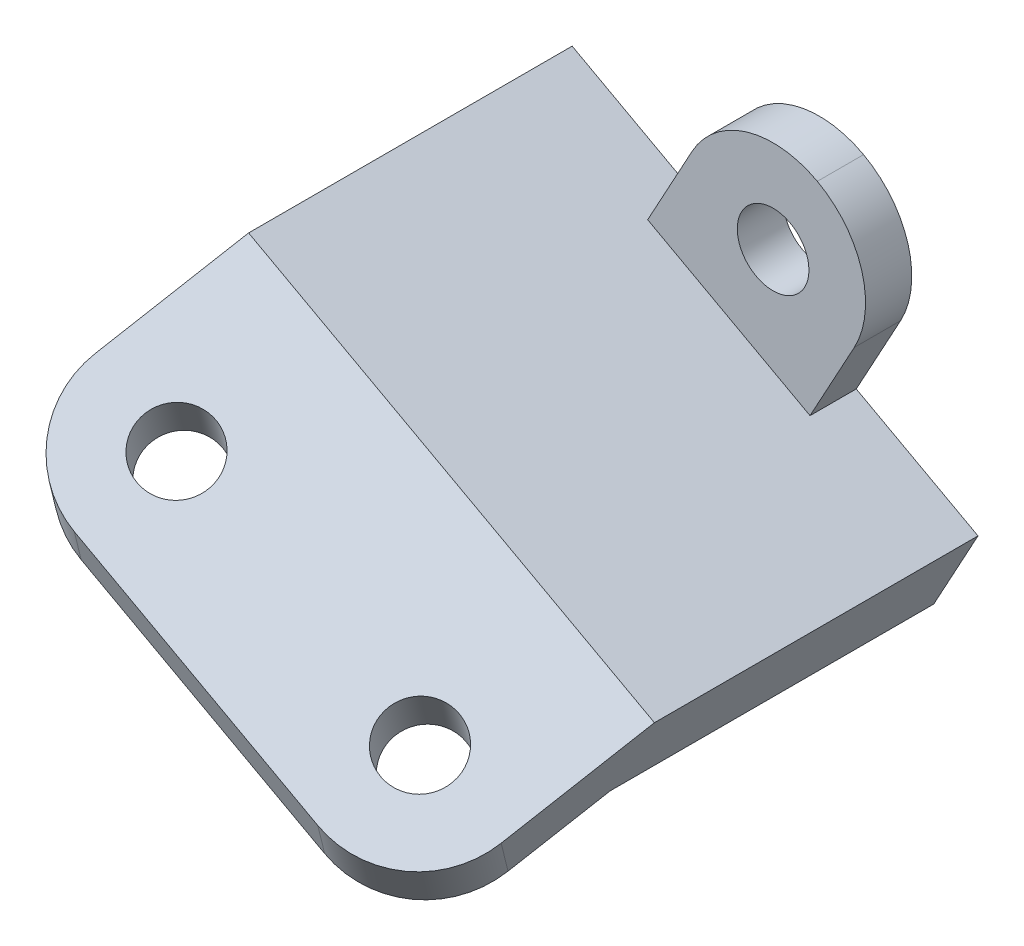
ISO-10303-21;
HEADER;
FILE_DESCRIPTION(('STEP AP214'),'2;1');
FILE_NAME('part.step','',(''),(''),'','','');
FILE_SCHEMA(('AUTOMOTIVE_DESIGN { 1 0 10303 214 1 1 1 1 }'));
ENDSEC;
DATA;
#1=APPLICATION_CONTEXT('core data for automotive mechanical design processes');
#2=APPLICATION_PROTOCOL_DEFINITION('international standard','automotive_design',2000,#1);
#3=PRODUCT_CONTEXT('',#1,'mechanical');
#4=PRODUCT('Part','Part','',(#3));
#5=PRODUCT_RELATED_PRODUCT_CATEGORY('part','',(#4));
#6=PRODUCT_DEFINITION_FORMATION('','',#4);
#7=PRODUCT_DEFINITION_CONTEXT('part definition',#1,'design');
#8=PRODUCT_DEFINITION('design','',#6,#7);
#9=PRODUCT_DEFINITION_SHAPE('','',#8);
#10=(LENGTH_UNIT() NAMED_UNIT(*) SI_UNIT(.MILLI.,.METRE.));
#11=(NAMED_UNIT(*) PLANE_ANGLE_UNIT() SI_UNIT($,.RADIAN.));
#12=(NAMED_UNIT(*) SI_UNIT($,.STERADIAN.) SOLID_ANGLE_UNIT());
#13=UNCERTAINTY_MEASURE_WITH_UNIT(LENGTH_MEASURE(1.E-05),#10,'distance_accuracy_value','');
#14=(GEOMETRIC_REPRESENTATION_CONTEXT(3) GLOBAL_UNCERTAINTY_ASSIGNED_CONTEXT((#13)) GLOBAL_UNIT_ASSIGNED_CONTEXT((#10,
#11,#12)) REPRESENTATION_CONTEXT('',''));
#15=CARTESIAN_POINT('',(0.,0.,0.));
#16=DIRECTION('',(0.,0.,1.));
#17=DIRECTION('',(1.,0.,0.));
#18=AXIS2_PLACEMENT_3D('',#15,#16,#17);
#19=CARTESIAN_POINT('',(53.4032280236198,101.07429996986,2.));
#20=DIRECTION('',(0.878015360581156,-0.478632454586546,0.));
#21=DIRECTION('',(0.478632454586546,0.878015360581156,0.));
#22=AXIS2_PLACEMENT_3D('',#19,#20,#21);
#23=PLANE('',#22);
#24=DIRECTION('',(-0.478632454586546,-0.878015360581156,0.));
#25=VECTOR('',#24,1.);
#26=CARTESIAN_POINT('',(53.4032280236198,101.07429996986,0.));
#27=LINE('',#26,#25);
#28=CARTESIAN_POINT('',(61.0613472970046,115.122545739158,0.));
#29=VERTEX_POINT('',#28);
#30=CARTESIAN_POINT('',(59.1468174786584,111.610484296834,0.));
#31=VERTEX_POINT('',#30);
#32=EDGE_CURVE('E254',#29,#31,#27,.T.);
#33=ORIENTED_EDGE('',*,*,#32,.T.);
#34=DIRECTION('',(0.,0.,1.));
#35=VECTOR('',#34,1.);
#36=CARTESIAN_POINT('',(59.1468174786584,111.610484296834,2.));
#37=LINE('',#36,#35);
#38=CARTESIAN_POINT('',(59.1468174786584,111.610484296834,2.));
#39=VERTEX_POINT('',#38);
#40=EDGE_CURVE('E229',#31,#39,#37,.T.);
#41=ORIENTED_EDGE('',*,*,#40,.T.);
#42=DIRECTION('',(-0.478632454586546,-0.878015360581156,0.));
#43=VECTOR('',#42,1.);
#44=CARTESIAN_POINT('',(53.4032280236198,101.07429996986,2.));
#45=LINE('',#44,#43);
#46=CARTESIAN_POINT('',(61.0613472970046,115.122545739158,2.));
#47=VERTEX_POINT('',#46);
#48=EDGE_CURVE('E245',#47,#39,#45,.T.);
#49=ORIENTED_EDGE('',*,*,#48,.F.);
#50=DIRECTION('',(0.,0.,-1.));
#51=VECTOR('',#50,1.);
#52=CARTESIAN_POINT('',(61.0613472970046,115.122545739158,2.));
#53=LINE('',#52,#51);
#54=EDGE_CURVE('E285',#47,#29,#53,.T.);
#55=ORIENTED_EDGE('',*,*,#54,.T.);
#56=EDGE_LOOP('',(#33,#41,#49,#55));
#57=FACE_BOUND('',#56,.T.);
#58=ADVANCED_FACE('F35',(#57),#23,.F.);
#59=CARTESIAN_POINT('',(70.,114.80554754479,2.));
#60=DIRECTION('',(-0.878015360581156,0.478632454586546,0.));
#61=DIRECTION('',(-0.478632454586546,-0.878015360581156,0.));
#62=AXIS2_PLACEMENT_3D('',#59,#60,#61);
#63=PLANE('',#62);
#64=DIRECTION('',(0.478632454586546,0.878015360581156,0.));
#65=VECTOR('',#64,1.);
#66=CARTESIAN_POINT('',(70.,114.80554754479,2.));
#67=LINE('',#66,#65);
#68=CARTESIAN_POINT('',(66.1709403633076,107.781424660141,2.));
#69=VERTEX_POINT('',#68);
#70=CARTESIAN_POINT('',(68.0854701816538,111.293486102466,2.));
#71=VERTEX_POINT('',#70);
#72=EDGE_CURVE('E248',#69,#71,#67,.T.);
#73=ORIENTED_EDGE('',*,*,#72,.F.);
#74=DIRECTION('',(0.,0.,-1.));
#75=VECTOR('',#74,1.);
#76=CARTESIAN_POINT('',(66.1709403633076,107.781424660141,2.));
#77=LINE('',#76,#75);
#78=CARTESIAN_POINT('',(66.1709403633076,107.781424660141,0.));
#79=VERTEX_POINT('',#78);
#80=EDGE_CURVE('E226',#69,#79,#77,.T.);
#81=ORIENTED_EDGE('',*,*,#80,.T.);
#82=DIRECTION('',(0.478632454586546,0.878015360581156,0.));
#83=VECTOR('',#82,1.);
#84=CARTESIAN_POINT('',(70.,114.80554754479,0.));
#85=LINE('',#84,#83);
#86=CARTESIAN_POINT('',(68.0854701816538,111.293486102466,0.));
#87=VERTEX_POINT('',#86);
#88=EDGE_CURVE('E257',#79,#87,#85,.T.);
#89=ORIENTED_EDGE('',*,*,#88,.T.);
#90=DIRECTION('',(0.,0.,-1.));
#91=VECTOR('',#90,1.);
#92=CARTESIAN_POINT('',(68.0854701816538,111.293486102466,2.));
#93=LINE('',#92,#91);
#94=EDGE_CURVE('E253',#87,#71,#93,.F.);
#95=ORIENTED_EDGE('',*,*,#94,.T.);
#96=EDGE_LOOP('',(#73,#81,#89,#95));
#97=FACE_BOUND('',#96,.T.);
#98=ADVANCED_FACE('F331',(#97),#63,.F.);
#99=CARTESIAN_POINT('',(0.,0.,2.));
#100=DIRECTION('',(0.,0.,-1.));
#101=DIRECTION('',(-1.,0.,0.));
#102=AXIS2_PLACEMENT_3D('',#99,#100,#101);
#103=PLANE('',#102);
#104=CARTESIAN_POINT('',(64.5734087393292,113.208015920812,2.));
#105=DIRECTION('',(0.,0.,1.));
#106=DIRECTION('',(1.,0.,0.));
#107=AXIS2_PLACEMENT_3D('',#104,#105,#106);
#108=CIRCLE('',#107,1.54999999999999);
#109=CARTESIAN_POINT('',(66.1234087393292,113.208015920812,2.));
#110=VERTEX_POINT('',#109);
#111=EDGE_CURVE('E239',#110,#110,#108,.T.);
#112=ORIENTED_EDGE('',*,*,#111,.F.);
#113=EDGE_LOOP('',(#112));
#114=FACE_BOUND('',#113,.T.);
#115=ORIENTED_EDGE('',*,*,#48,.T.);
#116=DIRECTION('',(0.878015360581156,-0.478632454586546,0.));
#117=VECTOR('',#116,1.);
#118=CARTESIAN_POINT('',(60.4538186597738,110.89799883069,2.));
#119=LINE('',#118,#117);
#120=EDGE_CURVE('E223',#39,#69,#119,.T.);
#121=ORIENTED_EDGE('',*,*,#120,.T.);
#122=ORIENTED_EDGE('',*,*,#72,.T.);
#123=CARTESIAN_POINT('',(64.5734087393292,113.208015920812,2.));
#124=DIRECTION('',(0.,0.,-1.));
#125=DIRECTION('',(-1.,0.,0.));
#126=AXIS2_PLACEMENT_3D('',#123,#124,#125);
#127=CIRCLE('',#126,4.);
#128=CARTESIAN_POINT('',(66.4879385576754,116.720077363137,2.));
#129=VERTEX_POINT('',#128);
#130=EDGE_CURVE('E279',#71,#129,#127,.F.);
#131=ORIENTED_EDGE('',*,*,#130,.T.);
#132=CARTESIAN_POINT('',(64.5734087393292,113.208015920812,2.));
#133=DIRECTION('',(0.,0.,-1.));
#134=DIRECTION('',(-1.,0.,0.));
#135=AXIS2_PLACEMENT_3D('',#132,#133,#134);
#136=CIRCLE('',#135,4.);
#137=EDGE_CURVE('E277',#129,#47,#136,.F.);
#138=ORIENTED_EDGE('',*,*,#137,.T.);
#139=EDGE_LOOP('',(#115,#121,#122,#131,#138));
#140=FACE_BOUND('',#139,.T.);
#141=ADVANCED_FACE('F335',(#114,#140),#103,.F.);
#142=CARTESIAN_POINT('',(57.2322876603122,108.098422854509,2.));
#143=VERTEX_POINT('',#142);
#144=CARTESIAN_POINT('',(55.317757841966,104.586361412184,2.));
#145=VERTEX_POINT('',#144);
#146=EDGE_CURVE('E249',#143,#145,#45,.T.);
#147=ORIENTED_EDGE('',*,*,#146,.F.);
#148=DIRECTION('',(0.,0.,-1.));
#149=VECTOR('',#148,1.);
#150=CARTESIAN_POINT('',(57.2322876603122,108.098422854509,2.));
#151=LINE('',#150,#149);
#152=CARTESIAN_POINT('',(57.2322876603122,108.098422854509,0.));
#153=VERTEX_POINT('',#152);
#154=EDGE_CURVE('E220',#143,#153,#151,.T.);
#155=ORIENTED_EDGE('',*,*,#154,.T.);
#156=CARTESIAN_POINT('',(55.317757841966,104.586361412184,0.));
#157=VERTEX_POINT('',#156);
#158=EDGE_CURVE('E258',#153,#157,#27,.T.);
#159=ORIENTED_EDGE('',*,*,#158,.T.);
#160=DIRECTION('',(0.,0.,-1.));
#161=VECTOR('',#160,1.);
#162=CARTESIAN_POINT('',(55.317757841966,104.586361412184,2.));
#163=LINE('',#162,#161);
#164=EDGE_CURVE('E287',#157,#145,#163,.F.);
#165=ORIENTED_EDGE('',*,*,#164,.T.);
#166=EDGE_LOOP('',(#147,#155,#159,#165));
#167=FACE_BOUND('',#166,.T.);
#168=ADVANCED_FACE('F385',(#167),#23,.F.);
#169=CARTESIAN_POINT('',(62.3418807266152,100.757301775492,0.));
#170=VERTEX_POINT('',#169);
#171=CARTESIAN_POINT('',(64.2564105449614,104.269363217817,0.));
#172=VERTEX_POINT('',#171);
#173=EDGE_CURVE('E259',#170,#172,#85,.T.);
#174=ORIENTED_EDGE('',*,*,#173,.T.);
#175=DIRECTION('',(0.,0.,1.));
#176=VECTOR('',#175,1.);
#177=CARTESIAN_POINT('',(64.2564105449614,104.269363217817,2.));
#178=LINE('',#177,#176);
#179=CARTESIAN_POINT('',(64.2564105449614,104.269363217817,2.));
#180=VERTEX_POINT('',#179);
#181=EDGE_CURVE('E217',#172,#180,#178,.T.);
#182=ORIENTED_EDGE('',*,*,#181,.T.);
#183=CARTESIAN_POINT('',(62.3418807266152,100.757301775492,2.));
#184=VERTEX_POINT('',#183);
#185=EDGE_CURVE('E250',#184,#180,#67,.T.);
#186=ORIENTED_EDGE('',*,*,#185,.F.);
#187=DIRECTION('',(0.,0.,-1.));
#188=VECTOR('',#187,1.);
#189=CARTESIAN_POINT('',(62.3418807266152,100.757301775492,2.));
#190=LINE('',#189,#188);
#191=EDGE_CURVE('E264',#184,#170,#190,.T.);
#192=ORIENTED_EDGE('',*,*,#191,.T.);
#193=EDGE_LOOP('',(#174,#182,#186,#192));
#194=FACE_BOUND('',#193,.T.);
#195=ADVANCED_FACE('F390',(#194),#63,.F.);
#196=CARTESIAN_POINT('',(58.8298192842906,102.671831593838,2.));
#197=DIRECTION('',(0.,0.,1.));
#198=DIRECTION('',(1.,0.,0.));
#199=AXIS2_PLACEMENT_3D('',#196,#197,#198);
#200=CIRCLE('',#199,1.55);
#201=CARTESIAN_POINT('',(60.3798192842906,102.671831593838,2.));
#202=VERTEX_POINT('',#201);
#203=EDGE_CURVE('E233',#202,#202,#200,.T.);
#204=ORIENTED_EDGE('',*,*,#203,.F.);
#205=EDGE_LOOP('',(#204));
#206=FACE_BOUND('',#205,.T.);
#207=ORIENTED_EDGE('',*,*,#185,.T.);
#208=DIRECTION('',(-0.878015360581156,0.478632454586547,0.));
#209=VECTOR('',#208,1.);
#210=CARTESIAN_POINT('',(58.5392888414276,107.385937388365,2.));
#211=LINE('',#210,#209);
#212=EDGE_CURVE('E180',#180,#143,#211,.T.);
#213=ORIENTED_EDGE('',*,*,#212,.T.);
#214=ORIENTED_EDGE('',*,*,#146,.T.);
#215=CARTESIAN_POINT('',(58.8298192842906,102.671831593838,2.));
#216=DIRECTION('',(0.,0.,-1.));
#217=DIRECTION('',(-1.,0.,0.));
#218=AXIS2_PLACEMENT_3D('',#215,#216,#217);
#219=CIRCLE('',#218,4.);
#220=CARTESIAN_POINT('',(56.9152894659444,99.1597701515135,2.));
#221=VERTEX_POINT('',#220);
#222=EDGE_CURVE('E281',#145,#221,#219,.F.);
#223=ORIENTED_EDGE('',*,*,#222,.T.);
#224=CARTESIAN_POINT('',(58.8298192842906,102.671831593838,2.));
#225=DIRECTION('',(0.,0.,-1.));
#226=DIRECTION('',(-1.,0.,0.));
#227=AXIS2_PLACEMENT_3D('',#224,#225,#226);
#228=CIRCLE('',#227,4.);
#229=EDGE_CURVE('E283',#221,#184,#228,.F.);
#230=ORIENTED_EDGE('',*,*,#229,.T.);
#231=EDGE_LOOP('',(#207,#213,#214,#223,#230));
#232=FACE_BOUND('',#231,.T.);
#233=ADVANCED_FACE('F398',(#206,#232),#103,.F.);
#234=CARTESIAN_POINT('',(0.,0.,0.));
#235=DIRECTION('',(0.,0.,-1.));
#236=DIRECTION('',(-1.,0.,0.));
#237=AXIS2_PLACEMENT_3D('',#234,#235,#236);
#238=PLANE('',#237);
#239=ORIENTED_EDGE('',*,*,#158,.F.);
#240=DIRECTION('',(0.878015360581156,-0.478632454586547,0.));
#241=VECTOR('',#240,1.);
#242=CARTESIAN_POINT('',(64.2564105449614,104.269363217817,0.));
#243=LINE('',#242,#241);
#244=CARTESIAN_POINT('',(51.9641954968253,110.970217582028,0.));
#245=VERTEX_POINT('',#244);
#246=EDGE_CURVE('E205',#245,#153,#243,.T.);
#247=ORIENTED_EDGE('',*,*,#246,.F.);
#248=DIRECTION('',(-0.478632454586541,-0.878015360581159,0.));
#249=VECTOR('',#248,1.);
#250=CARTESIAN_POINT('',(53.8787253151714,114.482279024353,0.));
#251=LINE('',#250,#249);
#252=CARTESIAN_POINT('',(53.8787253151714,114.482279024353,0.));
#253=VERTEX_POINT('',#252);
#254=EDGE_CURVE('E208',#253,#245,#251,.T.);
#255=ORIENTED_EDGE('',*,*,#254,.F.);
#256=DIRECTION('',(-0.878015360581156,0.478632454586546,0.));
#257=VECTOR('',#256,1.);
#258=CARTESIAN_POINT('',(59.1468174786584,111.610484296834,0.));
#259=LINE('',#258,#257);
#260=EDGE_CURVE('E200',#31,#253,#259,.T.);
#261=ORIENTED_EDGE('',*,*,#260,.F.);
#262=ORIENTED_EDGE('',*,*,#32,.F.);
#263=CARTESIAN_POINT('',(64.5734087393292,113.208015920812,0.));
#264=DIRECTION('',(0.,0.,-1.));
#265=DIRECTION('',(-1.,0.,0.));
#266=AXIS2_PLACEMENT_3D('',#263,#264,#265);
#267=CIRCLE('',#266,4.);
#268=CARTESIAN_POINT('',(66.4879385576754,116.720077363137,0.));
#269=VERTEX_POINT('',#268);
#270=EDGE_CURVE('E267',#29,#269,#267,.T.);
#271=ORIENTED_EDGE('',*,*,#270,.T.);
#272=CARTESIAN_POINT('',(64.5734087393292,113.208015920812,0.));
#273=DIRECTION('',(0.,0.,-1.));
#274=DIRECTION('',(-1.,0.,0.));
#275=AXIS2_PLACEMENT_3D('',#272,#273,#274);
#276=CIRCLE('',#275,4.);
#277=EDGE_CURVE('E269',#269,#87,#276,.T.);
#278=ORIENTED_EDGE('',*,*,#277,.T.);
#279=ORIENTED_EDGE('',*,*,#88,.F.);
#280=CARTESIAN_POINT('',(71.4390325267945,104.909629932622,0.));
#281=VERTEX_POINT('',#280);
#282=EDGE_CURVE('E201',#281,#79,#259,.T.);
#283=ORIENTED_EDGE('',*,*,#282,.F.);
#284=DIRECTION('',(0.478632454586546,0.878015360581156,0.));
#285=VECTOR('',#284,1.);
#286=CARTESIAN_POINT('',(69.5245027084484,101.397568490297,0.));
#287=LINE('',#286,#285);
#288=CARTESIAN_POINT('',(69.5245027084484,101.397568490297,0.));
#289=VERTEX_POINT('',#288);
#290=EDGE_CURVE('E179',#289,#281,#287,.T.);
#291=ORIENTED_EDGE('',*,*,#290,.F.);
#292=EDGE_CURVE('E207',#172,#289,#243,.T.);
#293=ORIENTED_EDGE('',*,*,#292,.F.);
#294=ORIENTED_EDGE('',*,*,#173,.F.);
#295=CARTESIAN_POINT('',(58.8298192842906,102.671831593838,0.));
#296=DIRECTION('',(0.,0.,-1.));
#297=DIRECTION('',(-1.,0.,0.));
#298=AXIS2_PLACEMENT_3D('',#295,#296,#297);
#299=CIRCLE('',#298,4.);
#300=CARTESIAN_POINT('',(56.9152894659444,99.1597701515135,0.));
#301=VERTEX_POINT('',#300);
#302=EDGE_CURVE('E275',#170,#301,#299,.T.);
#303=ORIENTED_EDGE('',*,*,#302,.T.);
#304=CARTESIAN_POINT('',(58.8298192842906,102.671831593838,0.));
#305=DIRECTION('',(0.,0.,-1.));
#306=DIRECTION('',(-1.,0.,0.));
#307=AXIS2_PLACEMENT_3D('',#304,#305,#306);
#308=CIRCLE('',#307,4.);
#309=EDGE_CURVE('E272',#301,#157,#308,.T.);
#310=ORIENTED_EDGE('',*,*,#309,.T.);
#311=EDGE_LOOP('',(#239,#247,#255,#261,#262,#271,#278,#279,#283,#291,#293,#294,#303,#310));
#312=FACE_BOUND('',#311,.T.);
#313=CARTESIAN_POINT('',(58.8298192842906,102.671831593838,0.));
#314=DIRECTION('',(0.,0.,-1.));
#315=DIRECTION('',(-1.,0.,0.));
#316=AXIS2_PLACEMENT_3D('',#313,#314,#315);
#317=CIRCLE('',#316,1.55);
#318=CARTESIAN_POINT('',(57.2798192842906,102.671831593838,0.));
#319=VERTEX_POINT('',#318);
#320=EDGE_CURVE('E232',#319,#319,#317,.F.);
#321=ORIENTED_EDGE('',*,*,#320,.T.);
#322=EDGE_LOOP('',(#321));
#323=FACE_BOUND('',#322,.T.);
#324=CARTESIAN_POINT('',(64.5734087393292,113.208015920812,0.));
#325=DIRECTION('',(0.,0.,-1.));
#326=DIRECTION('',(-1.,0.,0.));
#327=AXIS2_PLACEMENT_3D('',#324,#325,#326);
#328=CIRCLE('',#327,1.54999999999999);
#329=CARTESIAN_POINT('',(63.0234087393292,113.208015920812,0.));
#330=VERTEX_POINT('',#329);
#331=EDGE_CURVE('E236',#330,#330,#328,.F.);
#332=ORIENTED_EDGE('',*,*,#331,.T.);
#333=EDGE_LOOP('',(#332));
#334=FACE_BOUND('',#333,.T.);
#335=ADVANCED_FACE('F326',(#312,#323,#334),#238,.T.);
#336=CARTESIAN_POINT('',(58.8298192842906,102.671831593838,2.));
#337=DIRECTION('',(0.,0.,-1.));
#338=DIRECTION('',(-1.,0.,0.));
#339=AXIS2_PLACEMENT_3D('',#336,#337,#338);
#340=CYLINDRICAL_SURFACE('',#339,4.);
#341=DIRECTION('',(0.,0.,-1.));
#342=VECTOR('',#341,1.);
#343=CARTESIAN_POINT('',(56.9152894659444,99.1597701515135,2.));
#344=LINE('',#343,#342);
#345=EDGE_CURVE('E291',#221,#301,#344,.T.);
#346=ORIENTED_EDGE('',*,*,#345,.F.);
#347=ORIENTED_EDGE('',*,*,#222,.F.);
#348=ORIENTED_EDGE('',*,*,#164,.F.);
#349=ORIENTED_EDGE('',*,*,#309,.F.);
#350=EDGE_LOOP('',(#346,#347,#348,#349));
#351=FACE_BOUND('',#350,.T.);
#352=ADVANCED_FACE('F412',(#351),#340,.T.);
#353=CARTESIAN_POINT('',(58.8298192842906,102.671831593838,2.));
#354=DIRECTION('',(0.,0.,-1.));
#355=DIRECTION('',(-1.,0.,0.));
#356=AXIS2_PLACEMENT_3D('',#353,#354,#355);
#357=CYLINDRICAL_SURFACE('',#356,4.);
#358=ORIENTED_EDGE('',*,*,#229,.F.);
#359=ORIENTED_EDGE('',*,*,#345,.T.);
#360=ORIENTED_EDGE('',*,*,#302,.F.);
#361=ORIENTED_EDGE('',*,*,#191,.F.);
#362=EDGE_LOOP('',(#358,#359,#360,#361));
#363=FACE_BOUND('',#362,.T.);
#364=ADVANCED_FACE('F414',(#363),#357,.T.);
#365=CARTESIAN_POINT('',(64.5734087393292,113.208015920812,2.));
#366=DIRECTION('',(0.,0.,-1.));
#367=DIRECTION('',(-1.,0.,0.));
#368=AXIS2_PLACEMENT_3D('',#365,#366,#367);
#369=CYLINDRICAL_SURFACE('',#368,4.);
#370=ORIENTED_EDGE('',*,*,#54,.F.);
#371=ORIENTED_EDGE('',*,*,#137,.F.);
#372=DIRECTION('',(0.,0.,-1.));
#373=VECTOR('',#372,1.);
#374=CARTESIAN_POINT('',(66.4879385576754,116.720077363137,2.));
#375=LINE('',#374,#373);
#376=EDGE_CURVE('E242',#269,#129,#375,.F.);
#377=ORIENTED_EDGE('',*,*,#376,.F.);
#378=ORIENTED_EDGE('',*,*,#270,.F.);
#379=EDGE_LOOP('',(#370,#371,#377,#378));
#380=FACE_BOUND('',#379,.T.);
#381=ADVANCED_FACE('F344',(#380),#369,.T.);
#382=CARTESIAN_POINT('',(64.5734087393292,113.208015920812,2.));
#383=DIRECTION('',(0.,0.,-1.));
#384=DIRECTION('',(-1.,0.,0.));
#385=AXIS2_PLACEMENT_3D('',#382,#383,#384);
#386=CYLINDRICAL_SURFACE('',#385,4.);
#387=ORIENTED_EDGE('',*,*,#130,.F.);
#388=ORIENTED_EDGE('',*,*,#94,.F.);
#389=ORIENTED_EDGE('',*,*,#277,.F.);
#390=ORIENTED_EDGE('',*,*,#376,.T.);
#391=EDGE_LOOP('',(#387,#388,#389,#390));
#392=FACE_BOUND('',#391,.T.);
#393=ADVANCED_FACE('F338',(#392),#386,.T.);
#394=CARTESIAN_POINT('',(64.5734087393292,113.208015920812,-0.00100000000000013));
#395=DIRECTION('',(0.,0.,1.));
#396=DIRECTION('',(1.,0.,0.));
#397=AXIS2_PLACEMENT_3D('',#394,#395,#396);
#398=CYLINDRICAL_SURFACE('',#397,1.54999999999999);
#399=ORIENTED_EDGE('',*,*,#331,.F.);
#400=EDGE_LOOP('',(#399));
#401=FACE_BOUND('',#400,.T.);
#402=ORIENTED_EDGE('',*,*,#111,.T.);
#403=EDGE_LOOP('',(#402));
#404=FACE_BOUND('',#403,.T.);
#405=ADVANCED_FACE('F424',(#401,#404),#398,.F.);
#406=CARTESIAN_POINT('',(58.8298192842906,102.671831593838,-0.00100000000000013));
#407=DIRECTION('',(0.,0.,1.));
#408=DIRECTION('',(1.,0.,0.));
#409=AXIS2_PLACEMENT_3D('',#406,#407,#408);
#410=CYLINDRICAL_SURFACE('',#409,1.55);
#411=ORIENTED_EDGE('',*,*,#320,.F.);
#412=EDGE_LOOP('',(#411));
#413=FACE_BOUND('',#412,.T.);
#414=ORIENTED_EDGE('',*,*,#203,.T.);
#415=EDGE_LOOP('',(#414));
#416=FACE_BOUND('',#415,.T.);
#417=ADVANCED_FACE('F491',(#413,#416),#410,.F.);
#418=CARTESIAN_POINT('',(59.1468174786584,111.610484296834,-23.4622873374249));
#419=DIRECTION('',(0.478632454586546,0.878015360581156,0.));
#420=DIRECTION('',(-0.878015360581156,0.478632454586546,0.));
#421=AXIS2_PLACEMENT_3D('',#418,#419,#420);
#422=PLANE('',#421);
#423=ORIENTED_EDGE('',*,*,#40,.F.);
#424=ORIENTED_EDGE('',*,*,#260,.T.);
#425=DIRECTION('',(0.,0.,1.));
#426=VECTOR('',#425,1.);
#427=CARTESIAN_POINT('',(53.8787253151714,114.482279024353,-23.4622873374249));
#428=LINE('',#427,#426);
#429=CARTESIAN_POINT('',(53.8787253151714,114.482279024353,14.));
#430=VERTEX_POINT('',#429);
#431=EDGE_CURVE('E166',#253,#430,#428,.T.);
#432=ORIENTED_EDGE('',*,*,#431,.T.);
#433=DIRECTION('',(-0.878015360581156,0.478632454586547,0.));
#434=VECTOR('',#433,1.);
#435=CARTESIAN_POINT('',(66.1709403633076,107.781424660141,14.));
#436=LINE('',#435,#434);
#437=CARTESIAN_POINT('',(71.4390325267946,104.909629932622,14.));
#438=VERTEX_POINT('',#437);
#439=EDGE_CURVE('E161',#438,#430,#436,.T.);
#440=ORIENTED_EDGE('',*,*,#439,.F.);
#441=DIRECTION('',(0.,0.,1.));
#442=VECTOR('',#441,1.);
#443=CARTESIAN_POINT('',(71.4390325267945,104.909629932622,-23.4622873374249));
#444=LINE('',#443,#442);
#445=EDGE_CURVE('E164',#281,#438,#444,.T.);
#446=ORIENTED_EDGE('',*,*,#445,.F.);
#447=ORIENTED_EDGE('',*,*,#282,.T.);
#448=ORIENTED_EDGE('',*,*,#80,.F.);
#449=ORIENTED_EDGE('',*,*,#120,.F.);
#450=EDGE_LOOP('',(#423,#424,#432,#440,#446,#447,#448,#449));
#451=FACE_BOUND('',#450,.T.);
#452=ADVANCED_FACE('F163',(#451),#422,.T.);
#453=CARTESIAN_POINT('',(64.2564105449614,104.269363217817,-23.4622873374249));
#454=DIRECTION('',(-0.478632454586546,-0.878015360581156,0.));
#455=DIRECTION('',(0.878015360581156,-0.478632454586547,0.));
#456=AXIS2_PLACEMENT_3D('',#453,#454,#455);
#457=PLANE('',#456);
#458=ORIENTED_EDGE('',*,*,#154,.F.);
#459=ORIENTED_EDGE('',*,*,#212,.F.);
#460=ORIENTED_EDGE('',*,*,#181,.F.);
#461=ORIENTED_EDGE('',*,*,#292,.T.);
#462=DIRECTION('',(0.,0.,1.));
#463=VECTOR('',#462,1.);
#464=CARTESIAN_POINT('',(69.5245027084484,101.397568490297,-23.4622873374249));
#465=LINE('',#464,#463);
#466=CARTESIAN_POINT('',(69.5245027084484,101.397568490297,14.));
#467=VERTEX_POINT('',#466);
#468=EDGE_CURVE('E204',#289,#467,#465,.T.);
#469=ORIENTED_EDGE('',*,*,#468,.T.);
#470=DIRECTION('',(0.878015360581156,-0.478632454586547,0.));
#471=VECTOR('',#470,1.);
#472=CARTESIAN_POINT('',(51.9641954968253,110.970217582028,14.));
#473=LINE('',#472,#471);
#474=CARTESIAN_POINT('',(51.9641954968253,110.970217582028,14.));
#475=VERTEX_POINT('',#474);
#476=EDGE_CURVE('E168',#475,#467,#473,.T.);
#477=ORIENTED_EDGE('',*,*,#476,.F.);
#478=DIRECTION('',(0.,0.,1.));
#479=VECTOR('',#478,1.);
#480=CARTESIAN_POINT('',(51.9641954968253,110.970217582028,-23.4622873374249));
#481=LINE('',#480,#479);
#482=EDGE_CURVE('E210',#245,#475,#481,.T.);
#483=ORIENTED_EDGE('',*,*,#482,.F.);
#484=ORIENTED_EDGE('',*,*,#246,.T.);
#485=EDGE_LOOP('',(#458,#459,#460,#461,#469,#477,#483,#484));
#486=FACE_BOUND('',#485,.T.);
#487=ADVANCED_FACE('F321',(#486),#457,.T.);
#488=CARTESIAN_POINT('',(53.8787253151714,114.482279024353,-23.4622873374249));
#489=DIRECTION('',(-0.878015360581159,0.478632454586541,0.));
#490=DIRECTION('',(-0.478632454586541,-0.878015360581159,0.));
#491=AXIS2_PLACEMENT_3D('',#488,#489,#490);
#492=PLANE('',#491);
#493=DIRECTION('',(-0.239316227293269,-0.439007680290578,0.86602540378444));
#494=VECTOR('',#493,1.);
#495=CARTESIAN_POINT('',(40.2309283397022,89.4464184851707,56.4597510264363));
#496=LINE('',#495,#494);
#497=CARTESIAN_POINT('',(51.0069305876522,109.214186860866,17.4641016151378));
#498=VERTEX_POINT('',#497);
#499=EDGE_CURVE('E184',#475,#498,#496,.T.);
#500=ORIENTED_EDGE('',*,*,#499,.T.);
#501=DIRECTION('',(-0.414507864747645,-0.760383607176236,-0.500000000000003));
#502=VECTOR('',#501,1.);
#503=CARTESIAN_POINT('',(52.4428279514118,111.848232942609,19.1961524227067));
#504=LINE('',#503,#502);
#505=CARTESIAN_POINT('',(52.4428279514118,111.848232942609,19.1961524227066));
#506=VERTEX_POINT('',#505);
#507=EDGE_CURVE('E11',#498,#506,#504,.F.);
#508=ORIENTED_EDGE('',*,*,#507,.T.);
#509=DIRECTION('',(-0.239316227293271,-0.43900768029058,0.866025403784438));
#510=VECTOR('',#509,1.);
#511=CARTESIAN_POINT('',(41.6668257034616,92.0804645669138,58.1918018340054));
#512=LINE('',#511,#510);
#513=EDGE_CURVE('E186',#430,#506,#512,.T.);
#514=ORIENTED_EDGE('',*,*,#513,.F.);
#515=ORIENTED_EDGE('',*,*,#431,.F.);
#516=ORIENTED_EDGE('',*,*,#254,.T.);
#517=ORIENTED_EDGE('',*,*,#482,.T.);
#518=EDGE_LOOP('',(#500,#508,#514,#515,#516,#517));
#519=FACE_BOUND('',#518,.T.);
#520=ADVANCED_FACE('F350',(#519),#492,.T.);
#521=CARTESIAN_POINT('',(69.5245027084484,101.397568490297,-23.4622873374249));
#522=DIRECTION('',(0.878015360581156,-0.478632454586546,0.));
#523=DIRECTION('',(0.478632454586546,0.878015360581156,0.));
#524=AXIS2_PLACEMENT_3D('',#521,#522,#523);
#525=PLANE('',#524);
#526=DIRECTION('',(-0.239316227293273,-0.439007680290579,0.866025403784438));
#527=VECTOR('',#526,1.);
#528=CARTESIAN_POINT('',(59.2271329150847,82.5078154751831,58.1918018340053));
#529=LINE('',#528,#527);
#530=CARTESIAN_POINT('',(70.003135163035,102.275583850879,19.1961524227066));
#531=VERTEX_POINT('',#530);
#532=EDGE_CURVE('E169',#438,#531,#529,.T.);
#533=ORIENTED_EDGE('',*,*,#532,.T.);
#534=DIRECTION('',(-0.41450786474765,-0.760383607176234,-0.500000000000003));
#535=VECTOR('',#534,1.);
#536=CARTESIAN_POINT('',(68.5672377992754,99.6415377691351,17.4641016151378));
#537=LINE('',#536,#535);
#538=CARTESIAN_POINT('',(68.5672377992754,99.6415377691351,17.4641016151378));
#539=VERTEX_POINT('',#538);
#540=EDGE_CURVE('E290',#531,#539,#537,.T.);
#541=ORIENTED_EDGE('',*,*,#540,.T.);
#542=DIRECTION('',(-0.239316227293272,-0.439007680290576,0.86602540378444));
#543=VECTOR('',#542,1.);
#544=CARTESIAN_POINT('',(57.7912355513252,79.8737693934399,56.4597510264362));
#545=LINE('',#544,#543);
#546=EDGE_CURVE('E190',#467,#539,#545,.T.);
#547=ORIENTED_EDGE('',*,*,#546,.F.);
#548=ORIENTED_EDGE('',*,*,#468,.F.);
#549=ORIENTED_EDGE('',*,*,#290,.T.);
#550=ORIENTED_EDGE('',*,*,#445,.T.);
#551=EDGE_LOOP('',(#533,#541,#547,#548,#549,#550));
#552=FACE_BOUND('',#551,.T.);
#553=ADVANCED_FACE('F174',(#552),#525,.T.);
#554=CARTESIAN_POINT('',(31.15559963998,6.38037534027963,-35.5315477961612));
#555=DIRECTION('',(0.239316227293272,0.439007680290582,-0.866025403784437));
#556=DIRECTION('',(0.,0.891943793145156,0.452146292553451));
#557=AXIS2_PLACEMENT_3D('',#554,#555,#556);
#558=PLANE('',#557);
#559=DIRECTION('',(-0.878015360581159,0.478632454586541,0.));
#560=VECTOR('',#559,1.);
#561=CARTESIAN_POINT('',(77.9616213242836,92.2425136317874,20.9282032302755));
#562=LINE('',#561,#560);
#563=CARTESIAN_POINT('',(64.0979114477777,99.800036866319,20.9282032302755));
#564=VERTEX_POINT('',#563);
#565=CARTESIAN_POINT('',(53.5617271208038,105.543626321357,20.9282032302755));
#566=VERTEX_POINT('',#565);
#567=EDGE_CURVE('E192',#564,#566,#562,.T.);
#568=ORIENTED_EDGE('',*,*,#567,.F.);
#569=DIRECTION('',(-0.41450786474765,-0.760383607176234,-0.500000000000003));
#570=VECTOR('',#569,1.);
#571=CARTESIAN_POINT('',(65.5338088115373,102.434082948062,22.6602540378444));
#572=LINE('',#571,#570);
#573=CARTESIAN_POINT('',(65.5338088115373,102.434082948062,22.6602540378444));
#574=VERTEX_POINT('',#573);
#575=EDGE_CURVE('E304',#564,#574,#572,.F.);
#576=ORIENTED_EDGE('',*,*,#575,.T.);
#577=DIRECTION('',(-0.878015360581159,0.478632454586541,0.));
#578=VECTOR('',#577,1.);
#579=CARTESIAN_POINT('',(79.3975186880432,94.8765597135309,22.6602540378444));
#580=LINE('',#579,#578);
#581=CARTESIAN_POINT('',(54.9976244845634,108.177672403101,22.6602540378444));
#582=VERTEX_POINT('',#581);
#583=EDGE_CURVE('E195',#574,#582,#580,.T.);
#584=ORIENTED_EDGE('',*,*,#583,.T.);
#585=DIRECTION('',(-0.414507864747645,-0.760383607176236,-0.500000000000003));
#586=VECTOR('',#585,1.);
#587=CARTESIAN_POINT('',(53.5617271208038,105.543626321357,20.9282032302755));
#588=LINE('',#587,#586);
#589=EDGE_CURVE('E301',#582,#566,#588,.T.);
#590=ORIENTED_EDGE('',*,*,#589,.T.);
#591=EDGE_LOOP('',(#568,#576,#584,#590));
#592=FACE_BOUND('',#591,.T.);
#593=ADVANCED_FACE('F309',(#592),#558,.F.);
#594=CARTESIAN_POINT('',(68.1428839855066,74.2307759772545,56.4597510264363));
#595=DIRECTION('',(-0.414507864747647,-0.760383607176239,-0.499999999999998));
#596=DIRECTION('',(0.,0.54942293964704,-0.835544393428383));
#597=AXIS2_PLACEMENT_3D('',#594,#595,#596);
#598=PLANE('',#597);
#599=CARTESIAN_POINT('',(65.0551763569507,101.556067587481,17.4641016151378));
#600=DIRECTION('',(-0.414507864747647,-0.760383607176239,-0.499999999999998));
#601=DIRECTION('',(0.,0.54942293964704,-0.835544393428383));
#602=AXIS2_PLACEMENT_3D('',#599,#600,#601);
#603=CIRCLE('',#602,1.54999999999999);
#604=CARTESIAN_POINT('',(65.0551763569507,102.407673143934,16.1690078053238));
#605=VERTEX_POINT('',#604);
#606=EDGE_CURVE('E358',#605,#605,#603,.F.);
#607=ORIENTED_EDGE('',*,*,#606,.T.);
#608=EDGE_LOOP('',(#607));
#609=FACE_BOUND('',#608,.T.);
#610=CARTESIAN_POINT('',(54.5189920299768,107.29965704252,17.4641016151378));
#611=DIRECTION('',(-0.414507864747647,-0.760383607176239,-0.499999999999998));
#612=DIRECTION('',(0.,0.54942293964704,-0.835544393428383));
#613=AXIS2_PLACEMENT_3D('',#610,#611,#612);
#614=CIRCLE('',#613,1.55000000000001);
#615=CARTESIAN_POINT('',(54.5189920299768,108.151262598973,16.1690078053238));
#616=VERTEX_POINT('',#615);
#617=EDGE_CURVE('E352',#616,#616,#614,.F.);
#618=ORIENTED_EDGE('',*,*,#617,.T.);
#619=EDGE_LOOP('',(#618));
#620=FACE_BOUND('',#619,.T.);
#621=ORIENTED_EDGE('',*,*,#546,.T.);
#622=CARTESIAN_POINT('',(65.0551763569507,101.556067587481,17.4641016151378));
#623=DIRECTION('',(-0.414507864747647,-0.760383607176239,-0.499999999999998));
#624=DIRECTION('',(0.,0.54942293964704,-0.835544393428383));
#625=AXIS2_PLACEMENT_3D('',#622,#623,#624);
#626=CIRCLE('',#625,4.);
#627=EDGE_CURVE('E299',#539,#564,#626,.T.);
#628=ORIENTED_EDGE('',*,*,#627,.T.);
#629=ORIENTED_EDGE('',*,*,#567,.T.);
#630=CARTESIAN_POINT('',(54.5189920299768,107.29965704252,17.4641016151378));
#631=DIRECTION('',(-0.414507864747647,-0.760383607176239,-0.499999999999998));
#632=DIRECTION('',(0.,0.54942293964704,-0.835544393428383));
#633=AXIS2_PLACEMENT_3D('',#630,#631,#632);
#634=CIRCLE('',#633,4.);
#635=EDGE_CURVE('E297',#566,#498,#634,.T.);
#636=ORIENTED_EDGE('',*,*,#635,.T.);
#637=ORIENTED_EDGE('',*,*,#499,.F.);
#638=ORIENTED_EDGE('',*,*,#476,.T.);
#639=EDGE_LOOP('',(#621,#628,#629,#636,#637,#638));
#640=FACE_BOUND('',#639,.T.);
#641=ADVANCED_FACE('F316',(#609,#620,#640),#598,.T.);
#642=CARTESIAN_POINT('',(69.5787813492661,76.8648220589976,58.1918018340054));
#643=DIRECTION('',(-0.414507864747646,-0.760383607176237,-0.500000000000001));
#644=DIRECTION('',(0.,0.549422939647044,-0.835544393428381));
#645=AXIS2_PLACEMENT_3D('',#642,#643,#644);
#646=PLANE('',#645);
#647=CARTESIAN_POINT('',(66.4910737207103,104.190113669225,19.1961524227066));
#648=DIRECTION('',(0.414507864747646,0.760383607176238,0.500000000000001));
#649=DIRECTION('',(0.,-0.549422939647044,0.835544393428381));
#650=AXIS2_PLACEMENT_3D('',#647,#648,#649);
#651=CIRCLE('',#650,1.54999999999999);
#652=CARTESIAN_POINT('',(66.4910737207103,103.338508112772,20.4912462325206));
#653=VERTEX_POINT('',#652);
#654=EDGE_CURVE('E355',#653,#653,#651,.T.);
#655=ORIENTED_EDGE('',*,*,#654,.F.);
#656=EDGE_LOOP('',(#655));
#657=FACE_BOUND('',#656,.T.);
#658=CARTESIAN_POINT('',(55.9548893937364,109.933703124263,19.1961524227066));
#659=DIRECTION('',(0.414507864747646,0.760383607176238,0.500000000000001));
#660=DIRECTION('',(0.,-0.549422939647044,0.835544393428381));
#661=AXIS2_PLACEMENT_3D('',#658,#659,#660);
#662=CIRCLE('',#661,1.55000000000001);
#663=CARTESIAN_POINT('',(55.9548893937364,109.08209756781,20.4912462325206));
#664=VERTEX_POINT('',#663);
#665=EDGE_CURVE('E196',#664,#664,#662,.T.);
#666=ORIENTED_EDGE('',*,*,#665,.F.);
#667=EDGE_LOOP('',(#666));
#668=FACE_BOUND('',#667,.T.);
#669=ORIENTED_EDGE('',*,*,#583,.F.);
#670=CARTESIAN_POINT('',(66.4910737207103,104.190113669225,19.1961524227066));
#671=DIRECTION('',(-0.414507864747646,-0.760383607176237,-0.500000000000001));
#672=DIRECTION('',(0.,0.549422939647044,-0.835544393428381));
#673=AXIS2_PLACEMENT_3D('',#670,#671,#672);
#674=CIRCLE('',#673,4.);
#675=EDGE_CURVE('E43',#574,#531,#674,.F.);
#676=ORIENTED_EDGE('',*,*,#675,.T.);
#677=ORIENTED_EDGE('',*,*,#532,.F.);
#678=ORIENTED_EDGE('',*,*,#439,.T.);
#679=ORIENTED_EDGE('',*,*,#513,.T.);
#680=CARTESIAN_POINT('',(55.9548893937364,109.933703124263,19.1961524227066));
#681=DIRECTION('',(-0.414507864747646,-0.760383607176237,-0.500000000000001));
#682=DIRECTION('',(0.,0.549422939647044,-0.835544393428381));
#683=AXIS2_PLACEMENT_3D('',#680,#681,#682);
#684=CIRCLE('',#683,4.);
#685=EDGE_CURVE('E55',#506,#582,#684,.F.);
#686=ORIENTED_EDGE('',*,*,#685,.T.);
#687=EDGE_LOOP('',(#669,#676,#677,#678,#679,#686));
#688=FACE_BOUND('',#687,.T.);
#689=ADVANCED_FACE('F182',(#657,#668,#688),#646,.F.);
#690=CARTESIAN_POINT('',(57.2909699905512,87.3132129981292,8.09852978078135));
#691=DIRECTION('',(0.41450786474765,0.760383607176234,0.500000000000003));
#692=DIRECTION('',(0.,-0.549422939647047,0.835544393428378));
#693=AXIS2_PLACEMENT_3D('',#690,#691,#692);
#694=CYLINDRICAL_SURFACE('',#693,4.);
#695=ORIENTED_EDGE('',*,*,#675,.F.);
#696=ORIENTED_EDGE('',*,*,#575,.F.);
#697=ORIENTED_EDGE('',*,*,#627,.F.);
#698=ORIENTED_EDGE('',*,*,#540,.F.);
#699=EDGE_LOOP('',(#695,#696,#697,#698));
#700=FACE_BOUND('',#699,.T.);
#701=ADVANCED_FACE('F312',(#700),#694,.T.);
#702=CARTESIAN_POINT('',(7.71297034567324,21.437518751012,-38.995649411299));
#703=DIRECTION('',(0.414507864747645,0.760383607176236,0.500000000000003));
#704=DIRECTION('',(0.,-0.549422939647046,0.835544393428379));
#705=AXIS2_PLACEMENT_3D('',#702,#703,#704);
#706=CYLINDRICAL_SURFACE('',#705,4.);
#707=ORIENTED_EDGE('',*,*,#685,.F.);
#708=ORIENTED_EDGE('',*,*,#507,.F.);
#709=ORIENTED_EDGE('',*,*,#635,.F.);
#710=ORIENTED_EDGE('',*,*,#589,.F.);
#711=EDGE_LOOP('',(#707,#708,#709,#710));
#712=FACE_BOUND('',#711,.T.);
#713=ADVANCED_FACE('F37',(#712),#706,.T.);
#714=CARTESIAN_POINT('',(47.5539885300424,94.5228802050055,9.06256802279601));
#715=DIRECTION('',(0.414507864747646,0.760383607176237,0.500000000000001));
#716=DIRECTION('',(0.,-0.549422939647044,0.835544393428381));
#717=AXIS2_PLACEMENT_3D('',#714,#715,#716);
#718=CYLINDRICAL_SURFACE('',#717,1.55000000000001);
#719=ORIENTED_EDGE('',*,*,#617,.F.);
#720=EDGE_LOOP('',(#719));
#721=FACE_BOUND('',#720,.T.);
#722=ORIENTED_EDGE('',*,*,#665,.T.);
#723=EDGE_LOOP('',(#722));
#724=FACE_BOUND('',#723,.T.);
#725=ADVANCED_FACE('F371',(#721,#724),#718,.F.);
#726=CARTESIAN_POINT('',(58.0901728570163,88.779290749967,9.06256802279601));
#727=DIRECTION('',(0.414507864747646,0.760383607176237,0.500000000000001));
#728=DIRECTION('',(0.,-0.549422939647044,0.835544393428381));
#729=AXIS2_PLACEMENT_3D('',#726,#727,#728);
#730=CYLINDRICAL_SURFACE('',#729,1.54999999999999);
#731=ORIENTED_EDGE('',*,*,#606,.F.);
#732=EDGE_LOOP('',(#731));
#733=FACE_BOUND('',#732,.T.);
#734=ORIENTED_EDGE('',*,*,#654,.T.);
#735=EDGE_LOOP('',(#734));
#736=FACE_BOUND('',#735,.T.);
#737=ADVANCED_FACE('F364',(#733,#736),#730,.F.);
#738=CLOSED_SHELL('',(#58,#98,#141,#168,#195,#233,#335,#352,#364,#381,#393,#405,#417,#452,#487,
#520,#553,#593,#641,#689,#701,#713,#725,#737));
#739=MANIFOLD_SOLID_BREP('B2',#738);
#740=ADVANCED_BREP_SHAPE_REPRESENTATION('',(#18,#739),#14);
#741=SHAPE_DEFINITION_REPRESENTATION(#9,#740);
ENDSEC;
END-ISO-10303-21;
